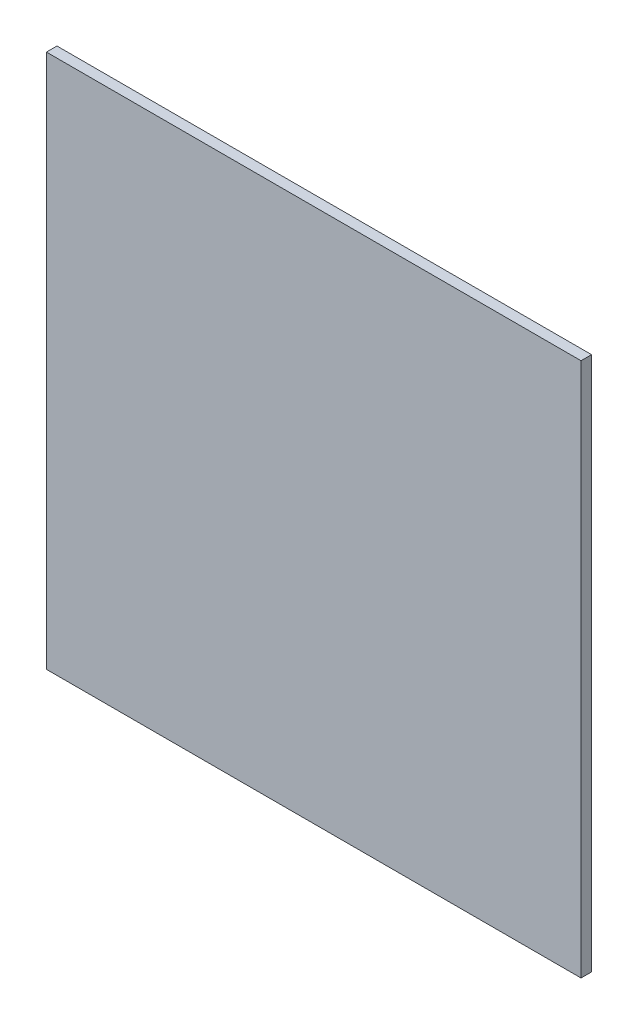
ISO-10303-21;
HEADER;
FILE_DESCRIPTION(('STEP AP214'),'2;1');
FILE_NAME('part.step','',(''),(''),'','','');
FILE_SCHEMA(('AUTOMOTIVE_DESIGN { 1 0 10303 214 1 1 1 1 }'));
ENDSEC;
DATA;
#1=APPLICATION_CONTEXT('core data for automotive mechanical design processes');
#2=APPLICATION_PROTOCOL_DEFINITION('international standard','automotive_design',2000,#1);
#3=PRODUCT_CONTEXT('',#1,'mechanical');
#4=PRODUCT('Part','Part','',(#3));
#5=PRODUCT_RELATED_PRODUCT_CATEGORY('part','',(#4));
#6=PRODUCT_DEFINITION_FORMATION('','',#4);
#7=PRODUCT_DEFINITION_CONTEXT('part definition',#1,'design');
#8=PRODUCT_DEFINITION('design','',#6,#7);
#9=PRODUCT_DEFINITION_SHAPE('','',#8);
#10=(LENGTH_UNIT() NAMED_UNIT(*) SI_UNIT(.MILLI.,.METRE.));
#11=(NAMED_UNIT(*) PLANE_ANGLE_UNIT() SI_UNIT($,.RADIAN.));
#12=(NAMED_UNIT(*) SI_UNIT($,.STERADIAN.) SOLID_ANGLE_UNIT());
#13=UNCERTAINTY_MEASURE_WITH_UNIT(LENGTH_MEASURE(1.E-05),#10,'distance_accuracy_value','');
#14=(GEOMETRIC_REPRESENTATION_CONTEXT(3) GLOBAL_UNCERTAINTY_ASSIGNED_CONTEXT((#13)) GLOBAL_UNIT_ASSIGNED_CONTEXT((#10,
#11,#12)) REPRESENTATION_CONTEXT('',''));
#15=CARTESIAN_POINT('',(0.,0.,0.));
#16=DIRECTION('',(0.,0.,1.));
#17=DIRECTION('',(1.,0.,0.));
#18=AXIS2_PLACEMENT_3D('',#15,#16,#17);
#19=CARTESIAN_POINT('',(-101.6,101.6,4.));
#20=DIRECTION('',(1.,0.,0.));
#21=DIRECTION('',(0.,1.,0.));
#22=AXIS2_PLACEMENT_3D('',#19,#20,#21);
#23=PLANE('',#22);
#24=DIRECTION('',(0.,-1.,0.));
#25=VECTOR('',#24,1.);
#26=CARTESIAN_POINT('',(-101.6,101.6,0.));
#27=LINE('',#26,#25);
#28=CARTESIAN_POINT('',(-101.6,101.6,0.));
#29=VERTEX_POINT('',#28);
#30=CARTESIAN_POINT('',(-101.6,-101.6,0.));
#31=VERTEX_POINT('',#30);
#32=EDGE_CURVE('E108',#29,#31,#27,.T.);
#33=ORIENTED_EDGE('',*,*,#32,.T.);
#34=DIRECTION('',(0.,0.,-1.));
#35=VECTOR('',#34,1.);
#36=CARTESIAN_POINT('',(-101.6,-101.6,4.));
#37=LINE('',#36,#35);
#38=CARTESIAN_POINT('',(-101.6,-101.6,4.));
#39=VERTEX_POINT('',#38);
#40=EDGE_CURVE('E11',#39,#31,#37,.T.);
#41=ORIENTED_EDGE('',*,*,#40,.F.);
#42=DIRECTION('',(0.,-1.,0.));
#43=VECTOR('',#42,1.);
#44=CARTESIAN_POINT('',(-101.6,101.6,4.));
#45=LINE('',#44,#43);
#46=CARTESIAN_POINT('',(-101.6,101.6,4.));
#47=VERTEX_POINT('',#46);
#48=EDGE_CURVE('E90',#47,#39,#45,.T.);
#49=ORIENTED_EDGE('',*,*,#48,.F.);
#50=DIRECTION('',(0.,0.,-1.));
#51=VECTOR('',#50,1.);
#52=CARTESIAN_POINT('',(-101.6,101.6,4.));
#53=LINE('',#52,#51);
#54=EDGE_CURVE('E104',#47,#29,#53,.T.);
#55=ORIENTED_EDGE('',*,*,#54,.T.);
#56=EDGE_LOOP('',(#33,#41,#49,#55));
#57=FACE_BOUND('',#56,.T.);
#58=ADVANCED_FACE('F38',(#57),#23,.F.);
#59=CARTESIAN_POINT('',(-101.6,-101.6,4.));
#60=DIRECTION('',(0.,1.,0.));
#61=DIRECTION('',(-1.,0.,0.));
#62=AXIS2_PLACEMENT_3D('',#59,#60,#61);
#63=PLANE('',#62);
#64=DIRECTION('',(1.,0.,0.));
#65=VECTOR('',#64,1.);
#66=CARTESIAN_POINT('',(-101.6,-101.6,0.));
#67=LINE('',#66,#65);
#68=CARTESIAN_POINT('',(101.6,-101.6,0.));
#69=VERTEX_POINT('',#68);
#70=EDGE_CURVE('E95',#31,#69,#67,.T.);
#71=ORIENTED_EDGE('',*,*,#70,.T.);
#72=DIRECTION('',(0.,0.,-1.));
#73=VECTOR('',#72,1.);
#74=CARTESIAN_POINT('',(101.6,-101.6,4.));
#75=LINE('',#74,#73);
#76=CARTESIAN_POINT('',(101.6,-101.6,4.));
#77=VERTEX_POINT('',#76);
#78=EDGE_CURVE('E47',#77,#69,#75,.T.);
#79=ORIENTED_EDGE('',*,*,#78,.F.);
#80=DIRECTION('',(1.,0.,0.));
#81=VECTOR('',#80,1.);
#82=CARTESIAN_POINT('',(-101.6,-101.6,4.));
#83=LINE('',#82,#81);
#84=EDGE_CURVE('E85',#39,#77,#83,.T.);
#85=ORIENTED_EDGE('',*,*,#84,.F.);
#86=ORIENTED_EDGE('',*,*,#40,.T.);
#87=EDGE_LOOP('',(#71,#79,#85,#86));
#88=FACE_BOUND('',#87,.T.);
#89=ADVANCED_FACE('F94',(#88),#63,.F.);
#90=CARTESIAN_POINT('',(101.6,101.6,4.));
#91=DIRECTION('',(-1.,0.,0.));
#92=DIRECTION('',(0.,0.,1.));
#93=AXIS2_PLACEMENT_3D('',#90,#91,#92);
#94=PLANE('',#93);
#95=DIRECTION('',(0.,1.,0.));
#96=VECTOR('',#95,1.);
#97=CARTESIAN_POINT('',(101.6,101.6,0.));
#98=LINE('',#97,#96);
#99=CARTESIAN_POINT('',(101.6,101.6,0.));
#100=VERTEX_POINT('',#99);
#101=EDGE_CURVE('E72',#69,#100,#98,.T.);
#102=ORIENTED_EDGE('',*,*,#101,.T.);
#103=DIRECTION('',(0.,0.,-1.));
#104=VECTOR('',#103,1.);
#105=CARTESIAN_POINT('',(101.6,101.6,4.));
#106=LINE('',#105,#104);
#107=CARTESIAN_POINT('',(101.6,101.6,4.));
#108=VERTEX_POINT('',#107);
#109=EDGE_CURVE('E97',#108,#100,#106,.T.);
#110=ORIENTED_EDGE('',*,*,#109,.F.);
#111=DIRECTION('',(0.,1.,0.));
#112=VECTOR('',#111,1.);
#113=CARTESIAN_POINT('',(101.6,101.6,4.));
#114=LINE('',#113,#112);
#115=EDGE_CURVE('E88',#77,#108,#114,.T.);
#116=ORIENTED_EDGE('',*,*,#115,.F.);
#117=ORIENTED_EDGE('',*,*,#78,.T.);
#118=EDGE_LOOP('',(#102,#110,#116,#117));
#119=FACE_BOUND('',#118,.T.);
#120=ADVANCED_FACE('F98',(#119),#94,.F.);
#121=CARTESIAN_POINT('',(-101.6,101.6,4.));
#122=DIRECTION('',(0.,-1.,0.));
#123=DIRECTION('',(1.,0.,0.));
#124=AXIS2_PLACEMENT_3D('',#121,#122,#123);
#125=PLANE('',#124);
#126=DIRECTION('',(-1.,0.,0.));
#127=VECTOR('',#126,1.);
#128=CARTESIAN_POINT('',(-101.6,101.6,0.));
#129=LINE('',#128,#127);
#130=EDGE_CURVE('E78',#100,#29,#129,.T.);
#131=ORIENTED_EDGE('',*,*,#130,.T.);
#132=ORIENTED_EDGE('',*,*,#54,.F.);
#133=DIRECTION('',(-1.,0.,0.));
#134=VECTOR('',#133,1.);
#135=CARTESIAN_POINT('',(-101.6,101.6,4.));
#136=LINE('',#135,#134);
#137=EDGE_CURVE('E55',#108,#47,#136,.T.);
#138=ORIENTED_EDGE('',*,*,#137,.F.);
#139=ORIENTED_EDGE('',*,*,#109,.T.);
#140=EDGE_LOOP('',(#131,#132,#138,#139));
#141=FACE_BOUND('',#140,.T.);
#142=ADVANCED_FACE('F119',(#141),#125,.F.);
#143=CARTESIAN_POINT('',(0.,0.,4.));
#144=DIRECTION('',(0.,0.,1.));
#145=DIRECTION('',(1.,0.,0.));
#146=AXIS2_PLACEMENT_3D('',#143,#144,#145);
#147=PLANE('',#146);
#148=ORIENTED_EDGE('',*,*,#48,.T.);
#149=ORIENTED_EDGE('',*,*,#84,.T.);
#150=ORIENTED_EDGE('',*,*,#115,.T.);
#151=ORIENTED_EDGE('',*,*,#137,.T.);
#152=EDGE_LOOP('',(#148,#149,#150,#151));
#153=FACE_BOUND('',#152,.T.);
#154=ADVANCED_FACE('F86',(#153),#147,.T.);
#155=CARTESIAN_POINT('',(0.,0.,0.));
#156=DIRECTION('',(0.,0.,1.));
#157=DIRECTION('',(1.,0.,0.));
#158=AXIS2_PLACEMENT_3D('',#155,#156,#157);
#159=PLANE('',#158);
#160=ORIENTED_EDGE('',*,*,#32,.F.);
#161=ORIENTED_EDGE('',*,*,#130,.F.);
#162=ORIENTED_EDGE('',*,*,#101,.F.);
#163=ORIENTED_EDGE('',*,*,#70,.F.);
#164=EDGE_LOOP('',(#160,#161,#162,#163));
#165=FACE_BOUND('',#164,.T.);
#166=ADVANCED_FACE('F122',(#165),#159,.F.);
#167=CLOSED_SHELL('',(#58,#89,#120,#142,#154,#166));
#168=MANIFOLD_SOLID_BREP('B2',#167);
#169=ADVANCED_BREP_SHAPE_REPRESENTATION('',(#18,#168),#14);
#170=SHAPE_DEFINITION_REPRESENTATION(#9,#169);
ENDSEC;
END-ISO-10303-21;
